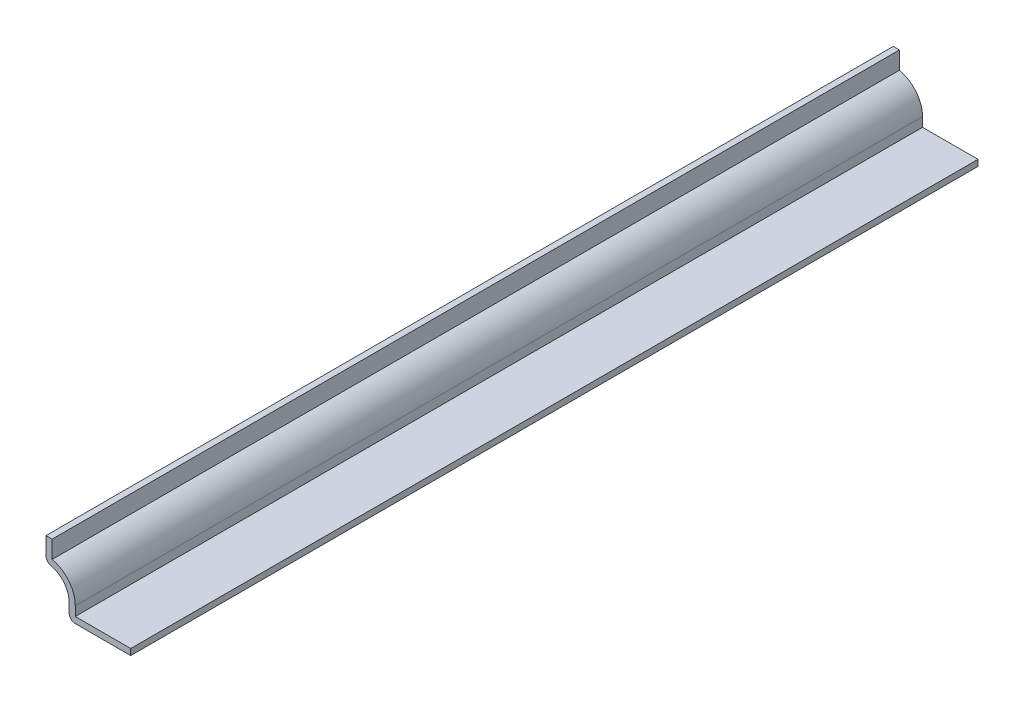
ISO-10303-21;
HEADER;
FILE_DESCRIPTION(('STEP AP214'),'2;1');
FILE_NAME('part.step','',(''),(''),'','','');
FILE_SCHEMA(('AUTOMOTIVE_DESIGN { 1 0 10303 214 1 1 1 1 }'));
ENDSEC;
DATA;
#1=APPLICATION_CONTEXT('core data for automotive mechanical design processes');
#2=APPLICATION_PROTOCOL_DEFINITION('international standard','automotive_design',2000,#1);
#3=PRODUCT_CONTEXT('',#1,'mechanical');
#4=PRODUCT('Part','Part','',(#3));
#5=PRODUCT_RELATED_PRODUCT_CATEGORY('part','',(#4));
#6=PRODUCT_DEFINITION_FORMATION('','',#4);
#7=PRODUCT_DEFINITION_CONTEXT('part definition',#1,'design');
#8=PRODUCT_DEFINITION('design','',#6,#7);
#9=PRODUCT_DEFINITION_SHAPE('','',#8);
#10=(LENGTH_UNIT() NAMED_UNIT(*) SI_UNIT(.MILLI.,.METRE.));
#11=(NAMED_UNIT(*) PLANE_ANGLE_UNIT() SI_UNIT($,.RADIAN.));
#12=(NAMED_UNIT(*) SI_UNIT($,.STERADIAN.) SOLID_ANGLE_UNIT());
#13=UNCERTAINTY_MEASURE_WITH_UNIT(LENGTH_MEASURE(1.E-05),#10,'distance_accuracy_value','');
#14=(GEOMETRIC_REPRESENTATION_CONTEXT(3) GLOBAL_UNCERTAINTY_ASSIGNED_CONTEXT((#13)) GLOBAL_UNIT_ASSIGNED_CONTEXT((#10,
#11,#12)) REPRESENTATION_CONTEXT('',''));
#15=CARTESIAN_POINT('',(0.,0.,0.));
#16=DIRECTION('',(0.,0.,1.));
#17=DIRECTION('',(1.,0.,0.));
#18=AXIS2_PLACEMENT_3D('',#15,#16,#17);
#19=CARTESIAN_POINT('',(-16.1925,7.93749999999999,-174.625));
#20=DIRECTION('',(1.,0.,0.));
#21=DIRECTION('',(0.,1.,0.));
#22=AXIS2_PLACEMENT_3D('',#19,#20,#21);
#23=PLANE('',#22);
#24=DIRECTION('',(0.,1.,0.));
#25=VECTOR('',#24,1.);
#26=CARTESIAN_POINT('',(-16.1925,7.93749999999999,0.));
#27=LINE('',#26,#25);
#28=CARTESIAN_POINT('',(-16.1925,9.07230075966963,0.));
#29=VERTEX_POINT('',#28);
#30=CARTESIAN_POINT('',(-16.1925,12.7,0.));
#31=VERTEX_POINT('',#30);
#32=EDGE_CURVE('E170',#29,#31,#27,.T.);
#33=ORIENTED_EDGE('',*,*,#32,.F.);
#34=DIRECTION('',(0.,0.,1.));
#35=VECTOR('',#34,1.);
#36=CARTESIAN_POINT('',(-16.1925,9.07230075966963,-174.625));
#37=LINE('',#36,#35);
#38=CARTESIAN_POINT('',(-16.1925,9.07230075966963,-174.625));
#39=VERTEX_POINT('',#38);
#40=EDGE_CURVE('E147',#39,#29,#37,.T.);
#41=ORIENTED_EDGE('',*,*,#40,.F.);
#42=DIRECTION('',(0.,1.,0.));
#43=VECTOR('',#42,1.);
#44=CARTESIAN_POINT('',(-16.1925,7.93749999999999,-174.625));
#45=LINE('',#44,#43);
#46=CARTESIAN_POINT('',(-16.1925,12.7,-174.625));
#47=VERTEX_POINT('',#46);
#48=EDGE_CURVE('E129',#39,#47,#45,.T.);
#49=ORIENTED_EDGE('',*,*,#48,.T.);
#50=DIRECTION('',(0.,0.,1.));
#51=VECTOR('',#50,1.);
#52=CARTESIAN_POINT('',(-16.1925,12.7,-174.625));
#53=LINE('',#52,#51);
#54=EDGE_CURVE('E137',#47,#31,#53,.T.);
#55=ORIENTED_EDGE('',*,*,#54,.T.);
#56=EDGE_LOOP('',(#33,#41,#49,#55));
#57=FACE_BOUND('',#56,.T.);
#58=ADVANCED_FACE('F35',(#57),#23,.T.);
#59=CARTESIAN_POINT('',(-17.4625,3.175,-174.625));
#60=DIRECTION('',(0.,0.,1.));
#61=DIRECTION('',(1.,0.,0.));
#62=AXIS2_PLACEMENT_3D('',#59,#60,#61);
#63=CYLINDRICAL_SURFACE('',#62,6.0325);
#64=CARTESIAN_POINT('',(-17.4625,3.175,0.));
#65=DIRECTION('',(0.,0.,1.));
#66=DIRECTION('',(1.,0.,0.));
#67=AXIS2_PLACEMENT_3D('',#64,#65,#66);
#68=CIRCLE('',#67,6.0325);
#69=CARTESIAN_POINT('',(-11.43,3.175,0.));
#70=VERTEX_POINT('',#69);
#71=EDGE_CURVE('E148',#70,#29,#68,.T.);
#72=ORIENTED_EDGE('',*,*,#71,.F.);
#73=DIRECTION('',(0.,0.,1.));
#74=VECTOR('',#73,1.);
#75=CARTESIAN_POINT('',(-11.43,3.175,-174.625));
#76=LINE('',#75,#74);
#77=CARTESIAN_POINT('',(-11.43,3.175,-174.625));
#78=VERTEX_POINT('',#77);
#79=EDGE_CURVE('E191',#78,#70,#76,.T.);
#80=ORIENTED_EDGE('',*,*,#79,.F.);
#81=CARTESIAN_POINT('',(-17.4625,3.175,-174.625));
#82=DIRECTION('',(0.,0.,1.));
#83=DIRECTION('',(1.,0.,0.));
#84=AXIS2_PLACEMENT_3D('',#81,#82,#83);
#85=CIRCLE('',#84,6.0325);
#86=EDGE_CURVE('E145',#78,#39,#85,.T.);
#87=ORIENTED_EDGE('',*,*,#86,.T.);
#88=ORIENTED_EDGE('',*,*,#40,.T.);
#89=EDGE_LOOP('',(#72,#80,#87,#88));
#90=FACE_BOUND('',#89,.T.);
#91=ADVANCED_FACE('F227',(#90),#63,.T.);
#92=CARTESIAN_POINT('',(-11.43,0.,-174.625));
#93=DIRECTION('',(1.,0.,0.));
#94=DIRECTION('',(0.,1.,0.));
#95=AXIS2_PLACEMENT_3D('',#92,#93,#94);
#96=PLANE('',#95);
#97=DIRECTION('',(0.,1.,0.));
#98=VECTOR('',#97,1.);
#99=CARTESIAN_POINT('',(-11.43,0.,0.));
#100=LINE('',#99,#98);
#101=CARTESIAN_POINT('',(-11.43,1.27,0.));
#102=VERTEX_POINT('',#101);
#103=EDGE_CURVE('E151',#102,#70,#100,.T.);
#104=ORIENTED_EDGE('',*,*,#103,.F.);
#105=DIRECTION('',(0.,0.,1.));
#106=VECTOR('',#105,1.);
#107=CARTESIAN_POINT('',(-11.43,1.27,-174.625));
#108=LINE('',#107,#106);
#109=CARTESIAN_POINT('',(-11.43,1.27,-174.625));
#110=VERTEX_POINT('',#109);
#111=EDGE_CURVE('E193',#110,#102,#108,.T.);
#112=ORIENTED_EDGE('',*,*,#111,.F.);
#113=DIRECTION('',(0.,1.,0.));
#114=VECTOR('',#113,1.);
#115=CARTESIAN_POINT('',(-11.43,0.,-174.625));
#116=LINE('',#115,#114);
#117=EDGE_CURVE('E166',#110,#78,#116,.T.);
#118=ORIENTED_EDGE('',*,*,#117,.T.);
#119=ORIENTED_EDGE('',*,*,#79,.T.);
#120=EDGE_LOOP('',(#104,#112,#118,#119));
#121=FACE_BOUND('',#120,.T.);
#122=ADVANCED_FACE('F261',(#121),#96,.T.);
#123=CARTESIAN_POINT('',(0.,1.27,-174.625));
#124=DIRECTION('',(0.,1.,0.));
#125=DIRECTION('',(-1.,0.,0.));
#126=AXIS2_PLACEMENT_3D('',#123,#124,#125);
#127=PLANE('',#126);
#128=DIRECTION('',(-1.,0.,0.));
#129=VECTOR('',#128,1.);
#130=CARTESIAN_POINT('',(0.,1.27,0.));
#131=LINE('',#130,#129);
#132=CARTESIAN_POINT('',(0.,1.27,0.));
#133=VERTEX_POINT('',#132);
#134=EDGE_CURVE('E184',#133,#102,#131,.T.);
#135=ORIENTED_EDGE('',*,*,#134,.F.);
#136=DIRECTION('',(0.,0.,1.));
#137=VECTOR('',#136,1.);
#138=CARTESIAN_POINT('',(0.,1.27,-174.625));
#139=LINE('',#138,#137);
#140=CARTESIAN_POINT('',(0.,1.27,-174.625));
#141=VERTEX_POINT('',#140);
#142=EDGE_CURVE('E195',#141,#133,#139,.T.);
#143=ORIENTED_EDGE('',*,*,#142,.F.);
#144=DIRECTION('',(-1.,0.,0.));
#145=VECTOR('',#144,1.);
#146=CARTESIAN_POINT('',(0.,1.27,-174.625));
#147=LINE('',#146,#145);
#148=EDGE_CURVE('E163',#141,#110,#147,.T.);
#149=ORIENTED_EDGE('',*,*,#148,.T.);
#150=ORIENTED_EDGE('',*,*,#111,.T.);
#151=EDGE_LOOP('',(#135,#143,#149,#150));
#152=FACE_BOUND('',#151,.T.);
#153=ADVANCED_FACE('F233',(#152),#127,.T.);
#154=CARTESIAN_POINT('',(0.,1.27,-174.625));
#155=DIRECTION('',(-1.,0.,0.));
#156=DIRECTION('',(0.,-1.,0.));
#157=AXIS2_PLACEMENT_3D('',#154,#155,#156);
#158=PLANE('',#157);
#159=DIRECTION('',(0.,-1.,0.));
#160=VECTOR('',#159,1.);
#161=CARTESIAN_POINT('',(0.,1.27,0.));
#162=LINE('',#161,#160);
#163=CARTESIAN_POINT('',(0.,0.,0.));
#164=VERTEX_POINT('',#163);
#165=EDGE_CURVE('E182',#133,#164,#162,.T.);
#166=ORIENTED_EDGE('',*,*,#165,.T.);
#167=DIRECTION('',(0.,0.,1.));
#168=VECTOR('',#167,1.);
#169=CARTESIAN_POINT('',(0.,0.,-174.625));
#170=LINE('',#169,#168);
#171=CARTESIAN_POINT('',(0.,0.,-174.625));
#172=VERTEX_POINT('',#171);
#173=EDGE_CURVE('E197',#172,#164,#170,.T.);
#174=ORIENTED_EDGE('',*,*,#173,.F.);
#175=DIRECTION('',(0.,-1.,0.));
#176=VECTOR('',#175,1.);
#177=CARTESIAN_POINT('',(0.,1.27,-174.625));
#178=LINE('',#177,#176);
#179=EDGE_CURVE('E161',#141,#172,#178,.T.);
#180=ORIENTED_EDGE('',*,*,#179,.F.);
#181=ORIENTED_EDGE('',*,*,#142,.T.);
#182=EDGE_LOOP('',(#166,#174,#180,#181));
#183=FACE_BOUND('',#182,.T.);
#184=ADVANCED_FACE('F238',(#183),#158,.F.);
#185=CARTESIAN_POINT('',(0.,0.,-174.625));
#186=DIRECTION('',(0.,1.,0.));
#187=DIRECTION('',(-1.,0.,0.));
#188=AXIS2_PLACEMENT_3D('',#185,#186,#187);
#189=PLANE('',#188);
#190=DIRECTION('',(-1.,0.,0.));
#191=VECTOR('',#190,1.);
#192=CARTESIAN_POINT('',(0.,0.,0.));
#193=LINE('',#192,#191);
#194=CARTESIAN_POINT('',(-11.43,0.,0.));
#195=VERTEX_POINT('',#194);
#196=EDGE_CURVE('E179',#164,#195,#193,.T.);
#197=ORIENTED_EDGE('',*,*,#196,.T.);
#198=DIRECTION('',(0.,0.,1.));
#199=VECTOR('',#198,1.);
#200=CARTESIAN_POINT('',(-11.43,0.,-174.625));
#201=LINE('',#200,#199);
#202=CARTESIAN_POINT('',(-11.43,0.,-174.625));
#203=VERTEX_POINT('',#202);
#204=EDGE_CURVE('E210',#195,#203,#201,.F.);
#205=ORIENTED_EDGE('',*,*,#204,.T.);
#206=DIRECTION('',(-1.,0.,0.));
#207=VECTOR('',#206,1.);
#208=CARTESIAN_POINT('',(0.,0.,-174.625));
#209=LINE('',#208,#207);
#210=EDGE_CURVE('E159',#172,#203,#209,.T.);
#211=ORIENTED_EDGE('',*,*,#210,.F.);
#212=ORIENTED_EDGE('',*,*,#173,.T.);
#213=EDGE_LOOP('',(#197,#205,#211,#212));
#214=FACE_BOUND('',#213,.T.);
#215=ADVANCED_FACE('F272',(#214),#189,.F.);
#216=CARTESIAN_POINT('',(-12.7,0.,-174.625));
#217=DIRECTION('',(1.,0.,0.));
#218=DIRECTION('',(0.,1.,0.));
#219=AXIS2_PLACEMENT_3D('',#216,#217,#218);
#220=PLANE('',#219);
#221=DIRECTION('',(0.,1.,0.));
#222=VECTOR('',#221,1.);
#223=CARTESIAN_POINT('',(-12.7,0.,-174.625));
#224=LINE('',#223,#222);
#225=CARTESIAN_POINT('',(-12.7,1.27,-174.625));
#226=VERTEX_POINT('',#225);
#227=CARTESIAN_POINT('',(-12.7,3.175,-174.625));
#228=VERTEX_POINT('',#227);
#229=EDGE_CURVE('E157',#226,#228,#224,.T.);
#230=ORIENTED_EDGE('',*,*,#229,.F.);
#231=DIRECTION('',(0.,0.,1.));
#232=VECTOR('',#231,1.);
#233=CARTESIAN_POINT('',(-12.7,1.27,-174.625));
#234=LINE('',#233,#232);
#235=CARTESIAN_POINT('',(-12.7,1.27,0.));
#236=VERTEX_POINT('',#235);
#237=EDGE_CURVE('E190',#226,#236,#234,.T.);
#238=ORIENTED_EDGE('',*,*,#237,.T.);
#239=DIRECTION('',(0.,1.,0.));
#240=VECTOR('',#239,1.);
#241=CARTESIAN_POINT('',(-12.7,0.,0.));
#242=LINE('',#241,#240);
#243=CARTESIAN_POINT('',(-12.7,3.175,0.));
#244=VERTEX_POINT('',#243);
#245=EDGE_CURVE('E177',#236,#244,#242,.T.);
#246=ORIENTED_EDGE('',*,*,#245,.T.);
#247=DIRECTION('',(0.,0.,1.));
#248=VECTOR('',#247,1.);
#249=CARTESIAN_POINT('',(-12.7,3.175,-174.625));
#250=LINE('',#249,#248);
#251=EDGE_CURVE('E200',#228,#244,#250,.T.);
#252=ORIENTED_EDGE('',*,*,#251,.F.);
#253=EDGE_LOOP('',(#230,#238,#246,#252));
#254=FACE_BOUND('',#253,.T.);
#255=ADVANCED_FACE('F248',(#254),#220,.F.);
#256=CARTESIAN_POINT('',(-17.4625,3.175,-174.625));
#257=DIRECTION('',(0.,0.,1.));
#258=DIRECTION('',(1.,0.,0.));
#259=AXIS2_PLACEMENT_3D('',#256,#257,#258);
#260=CYLINDRICAL_SURFACE('',#259,4.7625);
#261=CARTESIAN_POINT('',(-17.4625,3.175,0.));
#262=DIRECTION('',(0.,0.,1.));
#263=DIRECTION('',(1.,0.,0.));
#264=AXIS2_PLACEMENT_3D('',#261,#262,#263);
#265=CIRCLE('',#264,4.7625);
#266=CARTESIAN_POINT('',(-16.4598684210526,7.83076375763392,0.));
#267=VERTEX_POINT('',#266);
#268=EDGE_CURVE('E175',#244,#267,#265,.T.);
#269=ORIENTED_EDGE('',*,*,#268,.T.);
#270=DIRECTION('',(0.,0.,1.));
#271=VECTOR('',#270,1.);
#272=CARTESIAN_POINT('',(-16.4598684210526,7.83076375763392,-174.625));
#273=LINE('',#272,#271);
#274=CARTESIAN_POINT('',(-16.4598684210526,7.83076375763392,-174.625));
#275=VERTEX_POINT('',#274);
#276=EDGE_CURVE('E11',#267,#275,#273,.F.);
#277=ORIENTED_EDGE('',*,*,#276,.T.);
#278=CARTESIAN_POINT('',(-17.4625,3.175,-174.625));
#279=DIRECTION('',(0.,0.,1.));
#280=DIRECTION('',(1.,0.,0.));
#281=AXIS2_PLACEMENT_3D('',#278,#279,#280);
#282=CIRCLE('',#281,4.7625);
#283=EDGE_CURVE('E155',#228,#275,#282,.T.);
#284=ORIENTED_EDGE('',*,*,#283,.F.);
#285=ORIENTED_EDGE('',*,*,#251,.T.);
#286=EDGE_LOOP('',(#269,#277,#284,#285));
#287=FACE_BOUND('',#286,.T.);
#288=ADVANCED_FACE('F251',(#287),#260,.F.);
#289=CARTESIAN_POINT('',(-17.4625,7.9375,-174.625));
#290=DIRECTION('',(1.,0.,0.));
#291=DIRECTION('',(0.,1.,0.));
#292=AXIS2_PLACEMENT_3D('',#289,#290,#291);
#293=PLANE('',#292);
#294=DIRECTION('',(0.,1.,0.));
#295=VECTOR('',#294,1.);
#296=CARTESIAN_POINT('',(-17.4625,7.9375,-174.625));
#297=LINE('',#296,#295);
#298=CARTESIAN_POINT('',(-17.4625,9.07230075966963,-174.625));
#299=VERTEX_POINT('',#298);
#300=CARTESIAN_POINT('',(-17.4625,12.7,-174.625));
#301=VERTEX_POINT('',#300);
#302=EDGE_CURVE('E131',#299,#301,#297,.T.);
#303=ORIENTED_EDGE('',*,*,#302,.F.);
#304=DIRECTION('',(0.,0.,1.));
#305=VECTOR('',#304,1.);
#306=CARTESIAN_POINT('',(-17.4625,9.07230075966963,-174.625));
#307=LINE('',#306,#305);
#308=CARTESIAN_POINT('',(-17.4625,9.07230075966963,0.));
#309=VERTEX_POINT('',#308);
#310=EDGE_CURVE('E43',#299,#309,#307,.T.);
#311=ORIENTED_EDGE('',*,*,#310,.T.);
#312=DIRECTION('',(0.,1.,0.));
#313=VECTOR('',#312,1.);
#314=CARTESIAN_POINT('',(-17.4625,7.9375,0.));
#315=LINE('',#314,#313);
#316=CARTESIAN_POINT('',(-17.4625,12.7,0.));
#317=VERTEX_POINT('',#316);
#318=EDGE_CURVE('E173',#309,#317,#315,.T.);
#319=ORIENTED_EDGE('',*,*,#318,.T.);
#320=DIRECTION('',(0.,0.,1.));
#321=VECTOR('',#320,1.);
#322=CARTESIAN_POINT('',(-17.4625,12.7,-174.625));
#323=LINE('',#322,#321);
#324=EDGE_CURVE('E144',#301,#317,#323,.T.);
#325=ORIENTED_EDGE('',*,*,#324,.F.);
#326=EDGE_LOOP('',(#303,#311,#319,#325));
#327=FACE_BOUND('',#326,.T.);
#328=ADVANCED_FACE('F218',(#327),#293,.F.);
#329=CARTESIAN_POINT('',(-17.4625,12.7,-174.625));
#330=DIRECTION('',(0.,-1.,0.));
#331=DIRECTION('',(1.,0.,0.));
#332=AXIS2_PLACEMENT_3D('',#329,#330,#331);
#333=PLANE('',#332);
#334=DIRECTION('',(1.,0.,0.));
#335=VECTOR('',#334,1.);
#336=CARTESIAN_POINT('',(-17.4625,12.7,0.));
#337=LINE('',#336,#335);
#338=EDGE_CURVE('E140',#317,#31,#337,.T.);
#339=ORIENTED_EDGE('',*,*,#338,.T.);
#340=ORIENTED_EDGE('',*,*,#54,.F.);
#341=DIRECTION('',(1.,0.,0.));
#342=VECTOR('',#341,1.);
#343=CARTESIAN_POINT('',(-17.4625,12.7,-174.625));
#344=LINE('',#343,#342);
#345=EDGE_CURVE('E123',#301,#47,#344,.T.);
#346=ORIENTED_EDGE('',*,*,#345,.F.);
#347=ORIENTED_EDGE('',*,*,#324,.T.);
#348=EDGE_LOOP('',(#339,#340,#346,#347));
#349=FACE_BOUND('',#348,.T.);
#350=ADVANCED_FACE('F138',(#349),#333,.F.);
#351=CARTESIAN_POINT('',(-17.4625,3.175,-174.625));
#352=DIRECTION('',(0.,0.,1.));
#353=DIRECTION('',(1.,0.,0.));
#354=AXIS2_PLACEMENT_3D('',#351,#352,#353);
#355=PLANE('',#354);
#356=ORIENTED_EDGE('',*,*,#210,.T.);
#357=CARTESIAN_POINT('',(-11.43,1.27,-174.625));
#358=DIRECTION('',(0.,0.,1.));
#359=DIRECTION('',(1.,0.,0.));
#360=AXIS2_PLACEMENT_3D('',#357,#358,#359);
#361=CIRCLE('',#360,1.27);
#362=EDGE_CURVE('E213',#203,#226,#361,.F.);
#363=ORIENTED_EDGE('',*,*,#362,.T.);
#364=ORIENTED_EDGE('',*,*,#229,.T.);
#365=ORIENTED_EDGE('',*,*,#283,.T.);
#366=CARTESIAN_POINT('',(-16.1925,9.07230075966963,-174.625));
#367=DIRECTION('',(0.,0.,1.));
#368=DIRECTION('',(1.,0.,0.));
#369=AXIS2_PLACEMENT_3D('',#366,#367,#368);
#370=CIRCLE('',#369,1.27);
#371=EDGE_CURVE('E50',#275,#299,#370,.F.);
#372=ORIENTED_EDGE('',*,*,#371,.T.);
#373=ORIENTED_EDGE('',*,*,#302,.T.);
#374=ORIENTED_EDGE('',*,*,#345,.T.);
#375=ORIENTED_EDGE('',*,*,#48,.F.);
#376=ORIENTED_EDGE('',*,*,#86,.F.);
#377=ORIENTED_EDGE('',*,*,#117,.F.);
#378=ORIENTED_EDGE('',*,*,#148,.F.);
#379=ORIENTED_EDGE('',*,*,#179,.T.);
#380=EDGE_LOOP('',(#356,#363,#364,#365,#372,#373,#374,#375,#376,#377,#378,#379));
#381=FACE_BOUND('',#380,.T.);
#382=ADVANCED_FACE('F126',(#381),#355,.F.);
#383=CARTESIAN_POINT('',(-17.4625,3.175,0.));
#384=DIRECTION('',(0.,0.,1.));
#385=DIRECTION('',(1.,0.,0.));
#386=AXIS2_PLACEMENT_3D('',#383,#384,#385);
#387=PLANE('',#386);
#388=ORIENTED_EDGE('',*,*,#245,.F.);
#389=CARTESIAN_POINT('',(-11.43,1.27,0.));
#390=DIRECTION('',(0.,0.,1.));
#391=DIRECTION('',(1.,0.,0.));
#392=AXIS2_PLACEMENT_3D('',#389,#390,#391);
#393=CIRCLE('',#392,1.27);
#394=EDGE_CURVE('E208',#236,#195,#393,.T.);
#395=ORIENTED_EDGE('',*,*,#394,.T.);
#396=ORIENTED_EDGE('',*,*,#196,.F.);
#397=ORIENTED_EDGE('',*,*,#165,.F.);
#398=ORIENTED_EDGE('',*,*,#134,.T.);
#399=ORIENTED_EDGE('',*,*,#103,.T.);
#400=ORIENTED_EDGE('',*,*,#71,.T.);
#401=ORIENTED_EDGE('',*,*,#32,.T.);
#402=ORIENTED_EDGE('',*,*,#338,.F.);
#403=ORIENTED_EDGE('',*,*,#318,.F.);
#404=CARTESIAN_POINT('',(-16.1925,9.07230075966963,0.));
#405=DIRECTION('',(0.,0.,1.));
#406=DIRECTION('',(1.,0.,0.));
#407=AXIS2_PLACEMENT_3D('',#404,#405,#406);
#408=CIRCLE('',#407,1.27);
#409=EDGE_CURVE('E206',#309,#267,#408,.T.);
#410=ORIENTED_EDGE('',*,*,#409,.T.);
#411=ORIENTED_EDGE('',*,*,#268,.F.);
#412=EDGE_LOOP('',(#388,#395,#396,#397,#398,#399,#400,#401,#402,#403,#410,#411));
#413=FACE_BOUND('',#412,.T.);
#414=ADVANCED_FACE('F222',(#413),#387,.T.);
#415=CARTESIAN_POINT('',(-11.43,1.27,-174.625));
#416=DIRECTION('',(0.,0.,1.));
#417=DIRECTION('',(1.,0.,0.));
#418=AXIS2_PLACEMENT_3D('',#415,#416,#417);
#419=CYLINDRICAL_SURFACE('',#418,1.27);
#420=ORIENTED_EDGE('',*,*,#362,.F.);
#421=ORIENTED_EDGE('',*,*,#204,.F.);
#422=ORIENTED_EDGE('',*,*,#394,.F.);
#423=ORIENTED_EDGE('',*,*,#237,.F.);
#424=EDGE_LOOP('',(#420,#421,#422,#423));
#425=FACE_BOUND('',#424,.T.);
#426=ADVANCED_FACE('F246',(#425),#419,.T.);
#427=CARTESIAN_POINT('',(-16.1925,9.07230075966963,-174.625));
#428=DIRECTION('',(0.,0.,1.));
#429=DIRECTION('',(1.,0.,0.));
#430=AXIS2_PLACEMENT_3D('',#427,#428,#429);
#431=CYLINDRICAL_SURFACE('',#430,1.27);
#432=ORIENTED_EDGE('',*,*,#371,.F.);
#433=ORIENTED_EDGE('',*,*,#276,.F.);
#434=ORIENTED_EDGE('',*,*,#409,.F.);
#435=ORIENTED_EDGE('',*,*,#310,.F.);
#436=EDGE_LOOP('',(#432,#433,#434,#435));
#437=FACE_BOUND('',#436,.T.);
#438=ADVANCED_FACE('F37',(#437),#431,.T.);
#439=CLOSED_SHELL('',(#58,#91,#122,#153,#184,#215,#255,#288,#328,#350,#382,#414,#426,#438));
#440=MANIFOLD_SOLID_BREP('B2',#439);
#441=ADVANCED_BREP_SHAPE_REPRESENTATION('',(#18,#440),#14);
#442=SHAPE_DEFINITION_REPRESENTATION(#9,#441);
ENDSEC;
END-ISO-10303-21;
